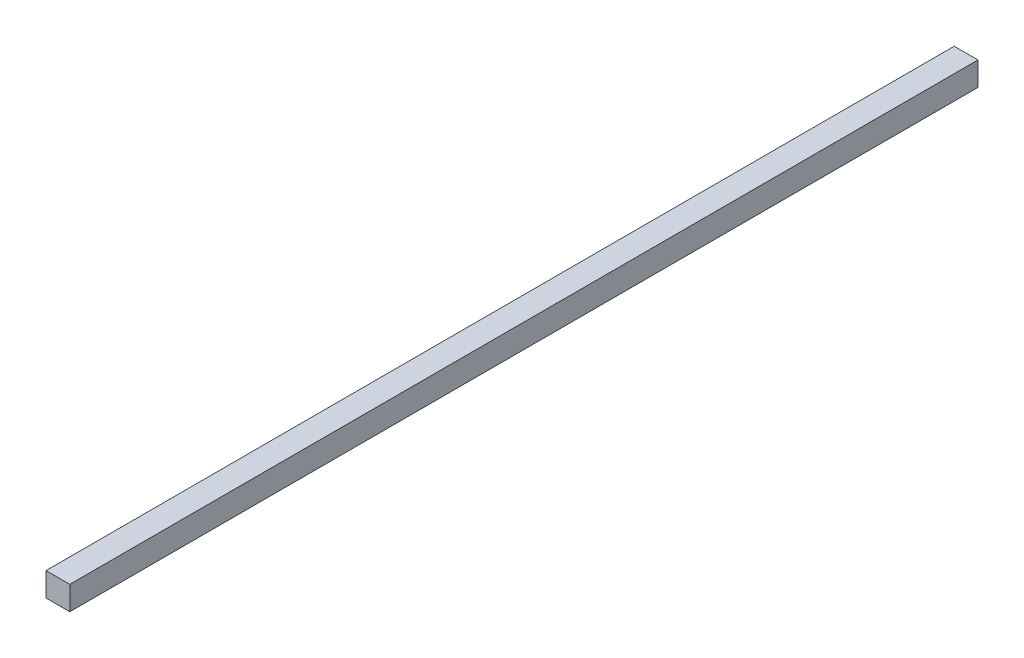
ISO-10303-21;
HEADER;
FILE_DESCRIPTION(('STEP AP214'),'2;1');
FILE_NAME('part.step','',(''),(''),'','','');
FILE_SCHEMA(('AUTOMOTIVE_DESIGN { 1 0 10303 214 1 1 1 1 }'));
ENDSEC;
DATA;
#1=APPLICATION_CONTEXT('core data for automotive mechanical design processes');
#2=APPLICATION_PROTOCOL_DEFINITION('international standard','automotive_design',2000,#1);
#3=PRODUCT_CONTEXT('',#1,'mechanical');
#4=PRODUCT('Part','Part','',(#3));
#5=PRODUCT_RELATED_PRODUCT_CATEGORY('part','',(#4));
#6=PRODUCT_DEFINITION_FORMATION('','',#4);
#7=PRODUCT_DEFINITION_CONTEXT('part definition',#1,'design');
#8=PRODUCT_DEFINITION('design','',#6,#7);
#9=PRODUCT_DEFINITION_SHAPE('','',#8);
#10=(LENGTH_UNIT() NAMED_UNIT(*) SI_UNIT(.MILLI.,.METRE.));
#11=(NAMED_UNIT(*) PLANE_ANGLE_UNIT() SI_UNIT($,.RADIAN.));
#12=(NAMED_UNIT(*) SI_UNIT($,.STERADIAN.) SOLID_ANGLE_UNIT());
#13=UNCERTAINTY_MEASURE_WITH_UNIT(LENGTH_MEASURE(1.E-05),#10,'distance_accuracy_value','');
#14=(GEOMETRIC_REPRESENTATION_CONTEXT(3) GLOBAL_UNCERTAINTY_ASSIGNED_CONTEXT((#13)) GLOBAL_UNIT_ASSIGNED_CONTEXT((#10,
#11,#12)) REPRESENTATION_CONTEXT('',''));
#15=CARTESIAN_POINT('',(0.,0.,0.));
#16=DIRECTION('',(0.,0.,1.));
#17=DIRECTION('',(1.,0.,0.));
#18=AXIS2_PLACEMENT_3D('',#15,#16,#17);
#19=CARTESIAN_POINT('',(10.,-10.,382.));
#20=DIRECTION('',(-1.,0.,0.));
#21=DIRECTION('',(0.,0.,1.));
#22=AXIS2_PLACEMENT_3D('',#19,#20,#21);
#23=PLANE('',#22);
#24=DIRECTION('',(0.,1.,0.));
#25=VECTOR('',#24,1.);
#26=CARTESIAN_POINT('',(10.,-10.,-382.));
#27=LINE('',#26,#25);
#28=CARTESIAN_POINT('',(10.,-10.,-382.));
#29=VERTEX_POINT('',#28);
#30=CARTESIAN_POINT('',(10.,10.,-382.));
#31=VERTEX_POINT('',#30);
#32=EDGE_CURVE('E98',#29,#31,#27,.T.);
#33=ORIENTED_EDGE('',*,*,#32,.T.);
#34=DIRECTION('',(0.,0.,-1.));
#35=VECTOR('',#34,1.);
#36=CARTESIAN_POINT('',(10.,10.,382.));
#37=LINE('',#36,#35);
#38=CARTESIAN_POINT('',(10.,10.,382.));
#39=VERTEX_POINT('',#38);
#40=EDGE_CURVE('E11',#39,#31,#37,.T.);
#41=ORIENTED_EDGE('',*,*,#40,.F.);
#42=DIRECTION('',(0.,1.,0.));
#43=VECTOR('',#42,1.);
#44=CARTESIAN_POINT('',(10.,-10.,382.));
#45=LINE('',#44,#43);
#46=CARTESIAN_POINT('',(10.,-10.,382.));
#47=VERTEX_POINT('',#46);
#48=EDGE_CURVE('E86',#47,#39,#45,.T.);
#49=ORIENTED_EDGE('',*,*,#48,.F.);
#50=DIRECTION('',(0.,0.,-1.));
#51=VECTOR('',#50,1.);
#52=CARTESIAN_POINT('',(10.,-10.,382.));
#53=LINE('',#52,#51);
#54=EDGE_CURVE('E94',#47,#29,#53,.T.);
#55=ORIENTED_EDGE('',*,*,#54,.T.);
#56=EDGE_LOOP('',(#33,#41,#49,#55));
#57=FACE_BOUND('',#56,.T.);
#58=ADVANCED_FACE('F35',(#57),#23,.F.);
#59=CARTESIAN_POINT('',(-10.,10.,382.));
#60=DIRECTION('',(0.,-1.,0.));
#61=DIRECTION('',(0.,0.,-1.));
#62=AXIS2_PLACEMENT_3D('',#59,#60,#61);
#63=PLANE('',#62);
#64=DIRECTION('',(-1.,0.,0.));
#65=VECTOR('',#64,1.);
#66=CARTESIAN_POINT('',(-10.,10.,-382.));
#67=LINE('',#66,#65);
#68=CARTESIAN_POINT('',(-10.,10.,-382.));
#69=VERTEX_POINT('',#68);
#70=EDGE_CURVE('E90',#31,#69,#67,.T.);
#71=ORIENTED_EDGE('',*,*,#70,.T.);
#72=DIRECTION('',(0.,0.,-1.));
#73=VECTOR('',#72,1.);
#74=CARTESIAN_POINT('',(-10.,10.,382.));
#75=LINE('',#74,#73);
#76=CARTESIAN_POINT('',(-10.,10.,382.));
#77=VERTEX_POINT('',#76);
#78=EDGE_CURVE('E43',#77,#69,#75,.T.);
#79=ORIENTED_EDGE('',*,*,#78,.F.);
#80=DIRECTION('',(-1.,0.,0.));
#81=VECTOR('',#80,1.);
#82=CARTESIAN_POINT('',(-10.,10.,382.));
#83=LINE('',#82,#81);
#84=EDGE_CURVE('E81',#39,#77,#83,.T.);
#85=ORIENTED_EDGE('',*,*,#84,.F.);
#86=ORIENTED_EDGE('',*,*,#40,.T.);
#87=EDGE_LOOP('',(#71,#79,#85,#86));
#88=FACE_BOUND('',#87,.T.);
#89=ADVANCED_FACE('F89',(#88),#63,.F.);
#90=CARTESIAN_POINT('',(-10.,-10.,382.));
#91=DIRECTION('',(1.,0.,0.));
#92=DIRECTION('',(0.,0.,-1.));
#93=AXIS2_PLACEMENT_3D('',#90,#91,#92);
#94=PLANE('',#93);
#95=DIRECTION('',(0.,-1.,0.));
#96=VECTOR('',#95,1.);
#97=CARTESIAN_POINT('',(-10.,-10.,-382.));
#98=LINE('',#97,#96);
#99=CARTESIAN_POINT('',(-10.,-10.,-382.));
#100=VERTEX_POINT('',#99);
#101=EDGE_CURVE('E68',#69,#100,#98,.T.);
#102=ORIENTED_EDGE('',*,*,#101,.T.);
#103=DIRECTION('',(0.,0.,-1.));
#104=VECTOR('',#103,1.);
#105=CARTESIAN_POINT('',(-10.,-10.,382.));
#106=LINE('',#105,#104);
#107=CARTESIAN_POINT('',(-10.,-10.,382.));
#108=VERTEX_POINT('',#107);
#109=EDGE_CURVE('E91',#108,#100,#106,.T.);
#110=ORIENTED_EDGE('',*,*,#109,.F.);
#111=DIRECTION('',(0.,-1.,0.));
#112=VECTOR('',#111,1.);
#113=CARTESIAN_POINT('',(-10.,-10.,382.));
#114=LINE('',#113,#112);
#115=EDGE_CURVE('E84',#77,#108,#114,.T.);
#116=ORIENTED_EDGE('',*,*,#115,.F.);
#117=ORIENTED_EDGE('',*,*,#78,.T.);
#118=EDGE_LOOP('',(#102,#110,#116,#117));
#119=FACE_BOUND('',#118,.T.);
#120=ADVANCED_FACE('F92',(#119),#94,.F.);
#121=CARTESIAN_POINT('',(-10.,-10.,382.));
#122=DIRECTION('',(0.,1.,0.));
#123=DIRECTION('',(0.,0.,1.));
#124=AXIS2_PLACEMENT_3D('',#121,#122,#123);
#125=PLANE('',#124);
#126=DIRECTION('',(1.,0.,0.));
#127=VECTOR('',#126,1.);
#128=CARTESIAN_POINT('',(-10.,-10.,-382.));
#129=LINE('',#128,#127);
#130=EDGE_CURVE('E74',#100,#29,#129,.T.);
#131=ORIENTED_EDGE('',*,*,#130,.T.);
#132=ORIENTED_EDGE('',*,*,#54,.F.);
#133=DIRECTION('',(1.,0.,0.));
#134=VECTOR('',#133,1.);
#135=CARTESIAN_POINT('',(-10.,-10.,382.));
#136=LINE('',#135,#134);
#137=EDGE_CURVE('E51',#108,#47,#136,.T.);
#138=ORIENTED_EDGE('',*,*,#137,.F.);
#139=ORIENTED_EDGE('',*,*,#109,.T.);
#140=EDGE_LOOP('',(#131,#132,#138,#139));
#141=FACE_BOUND('',#140,.T.);
#142=ADVANCED_FACE('F105',(#141),#125,.F.);
#143=CARTESIAN_POINT('',(0.,0.,382.));
#144=DIRECTION('',(0.,0.,-1.));
#145=DIRECTION('',(-1.,0.,0.));
#146=AXIS2_PLACEMENT_3D('',#143,#144,#145);
#147=PLANE('',#146);
#148=ORIENTED_EDGE('',*,*,#48,.T.);
#149=ORIENTED_EDGE('',*,*,#84,.T.);
#150=ORIENTED_EDGE('',*,*,#115,.T.);
#151=ORIENTED_EDGE('',*,*,#137,.T.);
#152=EDGE_LOOP('',(#148,#149,#150,#151));
#153=FACE_BOUND('',#152,.T.);
#154=ADVANCED_FACE('F82',(#153),#147,.F.);
#155=CARTESIAN_POINT('',(0.,0.,-382.));
#156=DIRECTION('',(0.,0.,-1.));
#157=DIRECTION('',(-1.,0.,0.));
#158=AXIS2_PLACEMENT_3D('',#155,#156,#157);
#159=PLANE('',#158);
#160=ORIENTED_EDGE('',*,*,#32,.F.);
#161=ORIENTED_EDGE('',*,*,#130,.F.);
#162=ORIENTED_EDGE('',*,*,#101,.F.);
#163=ORIENTED_EDGE('',*,*,#70,.F.);
#164=EDGE_LOOP('',(#160,#161,#162,#163));
#165=FACE_BOUND('',#164,.T.);
#166=ADVANCED_FACE('F108',(#165),#159,.T.);
#167=CLOSED_SHELL('',(#58,#89,#120,#142,#154,#166));
#168=MANIFOLD_SOLID_BREP('B2',#167);
#169=ADVANCED_BREP_SHAPE_REPRESENTATION('',(#18,#168),#14);
#170=SHAPE_DEFINITION_REPRESENTATION(#9,#169);
ENDSEC;
END-ISO-10303-21;
